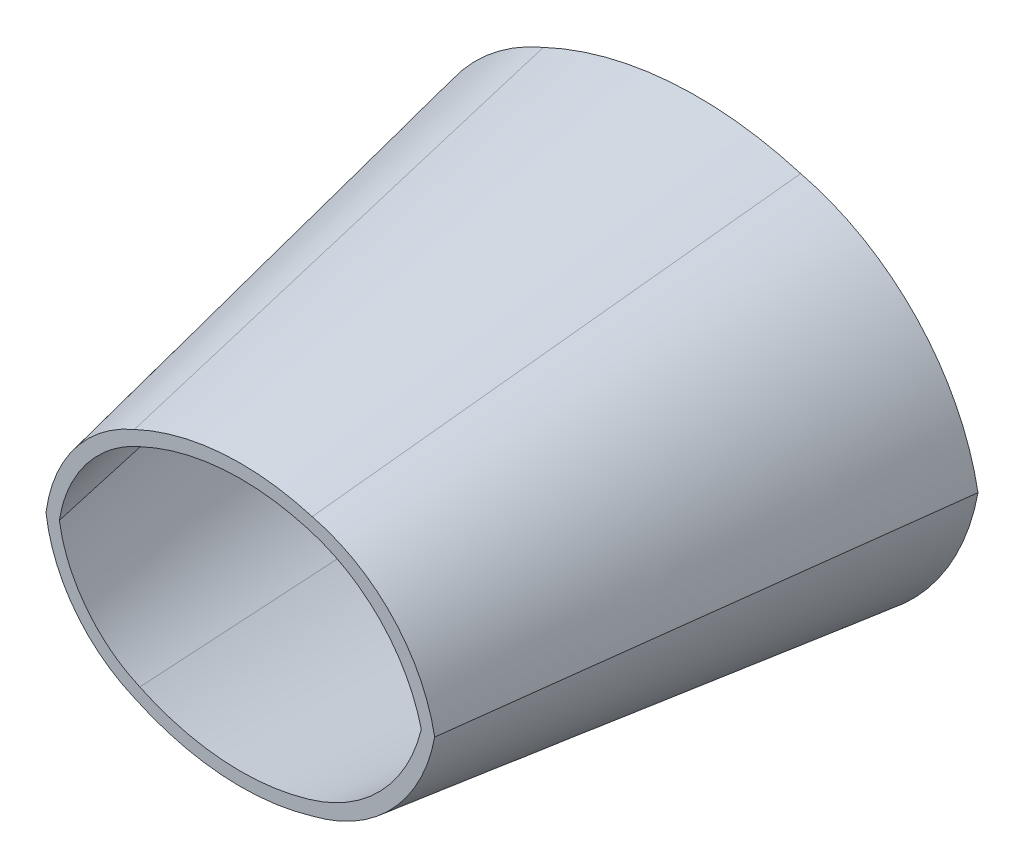
ISO-10303-21;
HEADER;
FILE_DESCRIPTION(('STEP AP214'),'2;1');
FILE_NAME('part.step','',(''),(''),'','','');
FILE_SCHEMA(('AUTOMOTIVE_DESIGN { 1 0 10303 214 1 1 1 1 }'));
ENDSEC;
DATA;
#1=APPLICATION_CONTEXT('core data for automotive mechanical design processes');
#2=APPLICATION_PROTOCOL_DEFINITION('international standard','automotive_design',2000,#1);
#3=PRODUCT_CONTEXT('',#1,'mechanical');
#4=PRODUCT('Part','Part','',(#3));
#5=PRODUCT_RELATED_PRODUCT_CATEGORY('part','',(#4));
#6=PRODUCT_DEFINITION_FORMATION('','',#4);
#7=PRODUCT_DEFINITION_CONTEXT('part definition',#1,'design');
#8=PRODUCT_DEFINITION('design','',#6,#7);
#9=PRODUCT_DEFINITION_SHAPE('','',#8);
#10=(LENGTH_UNIT() NAMED_UNIT(*) SI_UNIT(.MILLI.,.METRE.));
#11=(NAMED_UNIT(*) PLANE_ANGLE_UNIT() SI_UNIT($,.RADIAN.));
#12=(NAMED_UNIT(*) SI_UNIT($,.STERADIAN.) SOLID_ANGLE_UNIT());
#13=UNCERTAINTY_MEASURE_WITH_UNIT(LENGTH_MEASURE(1.E-05),#10,'distance_accuracy_value','');
#14=(GEOMETRIC_REPRESENTATION_CONTEXT(3) GLOBAL_UNCERTAINTY_ASSIGNED_CONTEXT((#13)) GLOBAL_UNIT_ASSIGNED_CONTEXT((#10,
#11,#12)) REPRESENTATION_CONTEXT('',''));
#15=CARTESIAN_POINT('',(0.,0.,0.));
#16=DIRECTION('',(0.,0.,1.));
#17=DIRECTION('',(1.,0.,0.));
#18=AXIS2_PLACEMENT_3D('',#15,#16,#17);
#19=CARTESIAN_POINT('',(-12.6655601020054,-8.00690456319089,0.));
#20=DIRECTION('',(0.,0.,-1.));
#21=DIRECTION('',(-1.,0.,0.));
#22=AXIS2_PLACEMENT_3D('',#19,#20,#21);
#23=PLANE('',#22);
#24=CARTESIAN_POINT('',(9.06036601108327,-10.222306806514,0.));
#25=DIRECTION('',(0.,0.,1.));
#26=DIRECTION('',(-1.,0.,0.));
#27=AXIS2_PLACEMENT_3D('',#24,#25,#26);
#28=CIRCLE('',#27,45.484296953617);
#29=CARTESIAN_POINT('',(53.793268102939,-1.98891505066619,0.));
#30=VERTEX_POINT('',#29);
#31=CARTESIAN_POINT('',(19.8193599105152,33.9711918062548,0.));
#32=VERTEX_POINT('',#31);
#33=EDGE_CURVE('E560',#30,#32,#28,.T.);
#34=ORIENTED_EDGE('',*,*,#33,.F.);
#35=CARTESIAN_POINT('',(9.06036601108326,6.24447670518163,0.));
#36=DIRECTION('',(0.,0.,-1.));
#37=DIRECTION('',(-1.,0.,0.));
#38=AXIS2_PLACEMENT_3D('',#35,#36,#37);
#39=CIRCLE('',#38,45.484296953617);
#40=CARTESIAN_POINT('',(19.8193599105153,-37.9490219075871,0.));
#41=VERTEX_POINT('',#40);
#42=EDGE_CURVE('E477',#30,#41,#39,.T.);
#43=ORIENTED_EDGE('',*,*,#42,.T.);
#44=CARTESIAN_POINT('',(0.0237006985835399,28.4188782777495,0.));
#45=DIRECTION('',(0.,0.,-1.));
#46=DIRECTION('',(-1.,0.,0.));
#47=AXIS2_PLACEMENT_3D('',#44,#45,#46);
#48=CIRCLE('',#47,69.2572472644253);
#49=CARTESIAN_POINT('',(-29.4869285013087,-34.2364412320272,0.));
#50=VERTEX_POINT('',#49);
#51=EDGE_CURVE('E487',#41,#50,#48,.T.);
#52=ORIENTED_EDGE('',*,*,#51,.T.);
#53=CARTESIAN_POINT('',(-13.7057072176419,3.18295541614373,0.));
#54=DIRECTION('',(0.,0.,-1.));
#55=DIRECTION('',(-1.,0.,0.));
#56=AXIS2_PLACEMENT_3D('',#53,#54,#55);
#57=CIRCLE('',#56,40.6110599555984);
#58=CARTESIAN_POINT('',(-53.9860988069965,-1.98891505066625,0.));
#59=VERTEX_POINT('',#58);
#60=EDGE_CURVE('E314',#50,#59,#57,.T.);
#61=ORIENTED_EDGE('',*,*,#60,.T.);
#62=CARTESIAN_POINT('',(-13.7057072176419,-7.16078551747613,0.));
#63=DIRECTION('',(0.,0.,1.));
#64=DIRECTION('',(-1.,0.,0.));
#65=AXIS2_PLACEMENT_3D('',#62,#63,#64);
#66=CIRCLE('',#65,40.6110599555984);
#67=CARTESIAN_POINT('',(-29.4869285013087,30.2586111306948,0.));
#68=VERTEX_POINT('',#67);
#69=EDGE_CURVE('E12',#68,#59,#66,.T.);
#70=ORIENTED_EDGE('',*,*,#69,.F.);
#71=CARTESIAN_POINT('',(0.0237006985835606,-32.3967083790819,0.));
#72=DIRECTION('',(0.,0.,1.));
#73=DIRECTION('',(-1.,0.,0.));
#74=AXIS2_PLACEMENT_3D('',#71,#72,#73);
#75=CIRCLE('',#74,69.2572472644253);
#76=EDGE_CURVE('E224',#32,#68,#75,.T.);
#77=ORIENTED_EDGE('',*,*,#76,.F.);
#78=EDGE_LOOP('',(#34,#43,#52,#61,#70,#77));
#79=FACE_BOUND('',#78,.T.);
#80=CARTESIAN_POINT('',(-12.6655601020054,-8.00690456319089,0.));
#81=DIRECTION('',(0.,0.,-1.));
#82=DIRECTION('',(-1.,0.,0.));
#83=AXIS2_PLACEMENT_3D('',#80,#81,#82);
#84=CIRCLE('',#83,38.098833712157);
#85=CARTESIAN_POINT('',(-50.2860988069965,-1.98891505066618,0.));
#86=VERTEX_POINT('',#85);
#87=CARTESIAN_POINT('',(-27.9797855687369,26.8785598680113,0.));
#88=VERTEX_POINT('',#87);
#89=EDGE_CURVE('E545',#86,#88,#84,.T.);
#90=ORIENTED_EDGE('',*,*,#89,.F.);
#91=CARTESIAN_POINT('',(-12.6655601020054,4.02907446185848,0.));
#92=DIRECTION('',(0.,0.,1.));
#93=DIRECTION('',(-1.,0.,0.));
#94=AXIS2_PLACEMENT_3D('',#91,#92,#93);
#95=CIRCLE('',#94,38.098833712157);
#96=CARTESIAN_POINT('',(-27.9797855687369,-30.8563899693437,0.));
#97=VERTEX_POINT('',#96);
#98=EDGE_CURVE('E443',#86,#97,#95,.T.);
#99=ORIENTED_EDGE('',*,*,#98,.T.);
#100=CARTESIAN_POINT('',(0.0237006985835399,28.4188782777495,0.));
#101=DIRECTION('',(0.,0.,1.));
#102=DIRECTION('',(-1.,0.,0.));
#103=AXIS2_PLACEMENT_3D('',#100,#101,#102);
#104=CIRCLE('',#103,65.5572472644242);
#105=CARTESIAN_POINT('',(18.7964914011617,-34.4235317513679,0.));
#106=VERTEX_POINT('',#105);
#107=EDGE_CURVE('E454',#97,#106,#104,.T.);
#108=ORIENTED_EDGE('',*,*,#107,.T.);
#109=CARTESIAN_POINT('',(6.60386853660439,8.69846982373068,0.));
#110=DIRECTION('',(0.,0.,1.));
#111=DIRECTION('',(-1.,0.,0.));
#112=AXIS2_PLACEMENT_3D('',#109,#110,#111);
#113=CIRCLE('',#112,44.7833459010578);
#114=CARTESIAN_POINT('',(50.0932681029389,-1.98891505066618,0.));
#115=VERTEX_POINT('',#114);
#116=EDGE_CURVE('E464',#106,#115,#113,.T.);
#117=ORIENTED_EDGE('',*,*,#116,.T.);
#118=CARTESIAN_POINT('',(6.6038685366044,-12.6762999250631,0.));
#119=DIRECTION('',(0.,0.,-1.));
#120=DIRECTION('',(-1.,0.,0.));
#121=AXIS2_PLACEMENT_3D('',#118,#119,#120);
#122=CIRCLE('',#121,44.7833459010578);
#123=CARTESIAN_POINT('',(18.7964914011616,30.4457016500356,0.));
#124=VERTEX_POINT('',#123);
#125=EDGE_CURVE('E238',#124,#115,#122,.T.);
#126=ORIENTED_EDGE('',*,*,#125,.F.);
#127=CARTESIAN_POINT('',(0.0237006985835606,-32.3967083790819,0.));
#128=DIRECTION('',(0.,0.,-1.));
#129=DIRECTION('',(-1.,0.,0.));
#130=AXIS2_PLACEMENT_3D('',#127,#128,#129);
#131=CIRCLE('',#130,65.5572472644242);
#132=EDGE_CURVE('E232',#88,#124,#131,.T.);
#133=ORIENTED_EDGE('',*,*,#132,.F.);
#134=EDGE_LOOP('',(#90,#99,#108,#117,#126,#133));
#135=FACE_BOUND('',#134,.T.);
#136=ADVANCED_FACE('F214',(#79,#135),#23,.T.);
#137=CARTESIAN_POINT('',(-3.61848238541433,-6.15479873574024,92.59));
#138=DIRECTION('',(0.,0.,1.));
#139=DIRECTION('',(1.,0.,0.));
#140=AXIS2_PLACEMENT_3D('',#137,#138,#139);
#141=PLANE('',#140);
#142=CARTESIAN_POINT('',(11.391568899451,3.70755016708821,92.59));
#143=DIRECTION('',(0.,0.,-1.));
#144=DIRECTION('',(1.,0.,0.));
#145=AXIS2_PLACEMENT_3D('',#142,#143,#144);
#146=CIRCLE('',#145,31.4242820479088);
#147=CARTESIAN_POINT('',(42.2952221826704,-1.98891505066618,92.59));
#148=VERTEX_POINT('',#147);
#149=CARTESIAN_POINT('',(18.8247641226774,-26.8249425414989,92.59));
#150=VERTEX_POINT('',#149);
#151=EDGE_CURVE('E330',#148,#150,#146,.T.);
#152=ORIENTED_EDGE('',*,*,#151,.F.);
#153=CARTESIAN_POINT('',(11.391568899451,-7.68538026842059,92.59));
#154=DIRECTION('',(0.,0.,1.));
#155=DIRECTION('',(1.,0.,0.));
#156=AXIS2_PLACEMENT_3D('',#153,#154,#155);
#157=CIRCLE('',#156,31.4242820479088);
#158=CARTESIAN_POINT('',(18.8247641226774,22.8471124401666,92.59));
#159=VERTEX_POINT('',#158);
#160=EDGE_CURVE('E526',#148,#159,#157,.T.);
#161=ORIENTED_EDGE('',*,*,#160,.T.);
#162=CARTESIAN_POINT('',(5.14829949501317,-23.005275175701,92.59));
#163=DIRECTION('',(0.,0.,1.));
#164=DIRECTION('',(1.,0.,0.));
#165=AXIS2_PLACEMENT_3D('',#162,#163,#164);
#166=CIRCLE('',#165,47.8485855045634);
#167=CARTESIAN_POINT('',(-15.2400630278623,20.2821572778798,92.59));
#168=VERTEX_POINT('',#167);
#169=EDGE_CURVE('E592',#159,#168,#166,.T.);
#170=ORIENTED_EDGE('',*,*,#169,.T.);
#171=CARTESIAN_POINT('',(-4.33710130496002,-5.57023031720181,92.59));
#172=DIRECTION('',(0.,0.,1.));
#173=DIRECTION('',(1.,0.,0.));
#174=AXIS2_PLACEMENT_3D('',#171,#172,#173);
#175=CIRCLE('',#174,28.0574503242437);
#176=CARTESIAN_POINT('',(-32.1650494804738,-1.98891505066618,92.59));
#177=VERTEX_POINT('',#176);
#178=EDGE_CURVE('E338',#168,#177,#175,.T.);
#179=ORIENTED_EDGE('',*,*,#178,.T.);
#180=CARTESIAN_POINT('',(-4.33710130496002,1.59240021586942,92.59));
#181=DIRECTION('',(0.,0.,-1.));
#182=DIRECTION('',(1.,0.,0.));
#183=AXIS2_PLACEMENT_3D('',#180,#181,#182);
#184=CIRCLE('',#183,28.0574503242437);
#185=CARTESIAN_POINT('',(-15.2400630278623,-24.2599873792122,92.59));
#186=VERTEX_POINT('',#185);
#187=EDGE_CURVE('E311',#186,#177,#184,.T.);
#188=ORIENTED_EDGE('',*,*,#187,.F.);
#189=CARTESIAN_POINT('',(5.14829949501315,19.0274450743686,92.59));
#190=DIRECTION('',(0.,0.,-1.));
#191=DIRECTION('',(1.,0.,0.));
#192=AXIS2_PLACEMENT_3D('',#189,#190,#191);
#193=CIRCLE('',#192,47.8485855045634);
#194=EDGE_CURVE('E323',#150,#186,#193,.T.);
#195=ORIENTED_EDGE('',*,*,#194,.F.);
#196=EDGE_LOOP('',(#152,#161,#170,#179,#188,#195));
#197=FACE_BOUND('',#196,.T.);
#198=CARTESIAN_POINT('',(-3.61848238541433,-6.15479873574024,92.59));
#199=DIRECTION('',(0.,0.,-1.));
#200=DIRECTION('',(1.,0.,0.));
#201=AXIS2_PLACEMENT_3D('',#198,#199,#200);
#202=CIRCLE('',#201,26.3217984327224);
#203=CARTESIAN_POINT('',(-29.6085282848602,-1.98891505066618,92.59));
#204=VERTEX_POINT('',#203);
#205=CARTESIAN_POINT('',(-14.1988051043368,17.9469407014108,92.59));
#206=VERTEX_POINT('',#205);
#207=EDGE_CURVE('E497',#204,#206,#202,.T.);
#208=ORIENTED_EDGE('',*,*,#207,.T.);
#209=CARTESIAN_POINT('',(5.14829949501317,-23.005275175701,92.59));
#210=DIRECTION('',(0.,0.,-1.));
#211=DIRECTION('',(1.,0.,0.));
#212=AXIS2_PLACEMENT_3D('',#209,#210,#211);
#213=CIRCLE('',#212,45.2923221045659);
#214=CARTESIAN_POINT('',(18.1180819645237,20.4114122697298,92.59));
#215=VERTEX_POINT('',#214);
#216=EDGE_CURVE('E525',#206,#215,#213,.T.);
#217=ORIENTED_EDGE('',*,*,#216,.T.);
#218=CARTESIAN_POINT('',(9.69441901128545,-9.38079994214532,92.59));
#219=DIRECTION('',(0.,0.,-1.));
#220=DIRECTION('',(1.,0.,0.));
#221=AXIS2_PLACEMENT_3D('',#218,#219,#220);
#222=CIRCLE('',#221,30.9400075828146);
#223=CARTESIAN_POINT('',(39.7384551412023,-1.98891505066618,92.59));
#224=VERTEX_POINT('',#223);
#225=EDGE_CURVE('E523',#215,#224,#222,.T.);
#226=ORIENTED_EDGE('',*,*,#225,.T.);
#227=CARTESIAN_POINT('',(9.69441901128545,5.40296984081294,92.59));
#228=DIRECTION('',(0.,0.,1.));
#229=DIRECTION('',(1.,0.,0.));
#230=AXIS2_PLACEMENT_3D('',#227,#228,#229);
#231=CIRCLE('',#230,30.9400075828146);
#232=CARTESIAN_POINT('',(18.1180819645237,-24.3892423710622,92.59));
#233=VERTEX_POINT('',#232);
#234=EDGE_CURVE('E527',#233,#224,#231,.T.);
#235=ORIENTED_EDGE('',*,*,#234,.F.);
#236=CARTESIAN_POINT('',(5.14829949501315,19.0274450743686,92.59));
#237=DIRECTION('',(0.,0.,1.));
#238=DIRECTION('',(1.,0.,0.));
#239=AXIS2_PLACEMENT_3D('',#236,#237,#238);
#240=CIRCLE('',#239,45.2923221045659);
#241=CARTESIAN_POINT('',(-14.1988051043368,-21.9247708027432,92.59));
#242=VERTEX_POINT('',#241);
#243=EDGE_CURVE('E429',#242,#233,#240,.T.);
#244=ORIENTED_EDGE('',*,*,#243,.F.);
#245=CARTESIAN_POINT('',(-3.61848238541433,2.17696863440785,92.59));
#246=DIRECTION('',(0.,0.,1.));
#247=DIRECTION('',(1.,0.,0.));
#248=AXIS2_PLACEMENT_3D('',#245,#246,#247);
#249=CIRCLE('',#248,26.3217984327224);
#250=EDGE_CURVE('E341',#204,#242,#249,.T.);
#251=ORIENTED_EDGE('',*,*,#250,.F.);
#252=EDGE_LOOP('',(#208,#217,#226,#235,#244,#251));
#253=FACE_BOUND('',#252,.T.);
#254=ADVANCED_FACE('F335',(#197,#253),#141,.T.);
#255=CARTESIAN_POINT('',(39.7384551412023,-1.98891505066616,92.59));
#256=CARTESIAN_POINT('',(50.0932681029389,-1.98891505066619,0.));
#257=CARTESIAN_POINT('',(39.0891569813181,0.650132724162398,92.59));
#258=CARTESIAN_POINT('',(49.1543754321577,1.83165274860205,0.));
#259=CARTESIAN_POINT('',(37.0915829083562,5.75580741413836,92.59));
#260=CARTESIAN_POINT('',(46.2643237885429,9.22418918531569,0.));
#261=CARTESIAN_POINT('',(32.2033559008326,12.3688938173354,92.5900000000001));
#262=CARTESIAN_POINT('',(39.1884041607721,18.8005768391056,0.));
#263=CARTESIAN_POINT('',(25.7618233026619,17.4810687791242,92.59));
#264=CARTESIAN_POINT('',(29.8623611382587,26.2033304225062,0.));
#265=CARTESIAN_POINT('',(20.7276681281979,19.6525884995614,92.59));
#266=CARTESIAN_POINT('',(22.5741550442845,29.3472205927666,0.));
#267=CARTESIAN_POINT('',(15.4666684735592,21.182398723251,92.59));
#268=CARTESIAN_POINT('',(14.9582781031926,31.5617895286514,0.));
#269=CARTESIAN_POINT('',(10.0299431853361,22.2781018317451,92.5899999999999));
#270=CARTESIAN_POINT('',(7.08878210891418,33.1476199730223,0.));
#271=CARTESIAN_POINT('',(1.71156322772433,22.4104894891621,92.59));
#272=CARTESIAN_POINT('',(-4.95071439823449,33.3391665360914,0.));
#273=CARTESIAN_POINT('',(-6.49216878035074,21.027828015512,92.5900000000001));
#274=CARTESIAN_POINT('',(-16.8242861947417,31.3380520904247,0.));
#275=CARTESIAN_POINT('',(-11.7020976662892,19.1264631991147,92.59));
#276=CARTESIAN_POINT('',(-24.3655263301193,28.5860487069188,0.));
#277=CARTESIAN_POINT('',(-14.1988051043368,17.9469407014108,92.59));
#278=CARTESIAN_POINT('',(-27.9797855687369,26.8785598680113,0.));
#279=B_SPLINE_SURFACE_WITH_KNOTS('',3,1,((#255,#256),(#257,#258),(#259,#260),(#261,#262),(#263,
#264),(#265,#266),(#267,#268),(#269,#270),(#271,#272),(#273,#274),(#275,#276),(#277,#278)),
.UNSPECIFIED.,.F.,.F.,.F.,(4,1,1,1,2,1,1,1,4),(2,2),(0.,0.124006247559485,0.24801249511897,
0.372018742678454,0.496024990237939,0.622018742678454,0.74801249511897,0.874006247559485,1.),
(0.,1.),.UNSPECIFIED.);
#280=DIRECTION('',(-0.146551474496138,0.094981773022944,-0.98463248378084));
#281=VECTOR('',#280,1.);
#282=CARTESIAN_POINT('',(-21.0892953365369,22.412750284711,46.295));
#283=LINE('',#282,#281);
#284=EDGE_CURVE('E659',#206,#88,#283,.T.);
#285=DIRECTION('',(0.111142237990361,0.,-0.993804509415455));
#286=VECTOR('',#285,1.);
#287=CARTESIAN_POINT('',(44.9158616220706,-1.98891505066618,46.295));
#288=LINE('',#287,#286);
#289=EDGE_CURVE('E666',#224,#115,#288,.T.);
#290=ORIENTED_EDGE('',*,*,#225,.F.);
#291=ORIENTED_EDGE('',*,*,#216,.F.);
#292=ORIENTED_EDGE('',*,*,#284,.T.);
#293=ORIENTED_EDGE('',*,*,#132,.T.);
#294=ORIENTED_EDGE('',*,*,#125,.T.);
#295=ORIENTED_EDGE('',*,*,#289,.F.);
#296=EDGE_LOOP('',(#290,#291,#292,#293,#294,#295));
#297=FACE_BOUND('',#296,.T.);
#298=ADVANCED_FACE('F361',(#297),#279,.T.);
#299=CARTESIAN_POINT('',(18.8247641226774,22.8471124401665,92.59));
#300=CARTESIAN_POINT('',(19.8193599105153,33.9711918062548,0.));
#301=CARTESIAN_POINT('',(30.856735460675,19.9179054235889,92.59));
#302=CARTESIAN_POINT('',(37.2389639166056,29.73035505164,0.));
#303=CARTESIAN_POINT('',(40.050410175931,10.1893199232026,92.59));
#304=CARTESIAN_POINT('',(50.5479395248472,15.6433038263927,0.));
#305=CARTESIAN_POINT('',(42.2952221826704,-1.98891505066618,92.59));
#306=CARTESIAN_POINT('',(53.793268102939,-1.9889150506662,0.));
#307=B_SPLINE_SURFACE_WITH_KNOTS('',3,1,((#299,#300),(#301,#302),(#303,#304),(#305,#306)),
.UNSPECIFIED.,.F.,.F.,.F.,(4,4),(2,2),(0.,1.),(0.,1.),.UNSPECIFIED.);
#308=DIRECTION('',(-0.123235782853256,0.,0.992377419042042));
#309=VECTOR('',#308,1.);
#310=CARTESIAN_POINT('',(48.0442451428047,-1.98891505066618,46.295));
#311=LINE('',#310,#309);
#312=EDGE_CURVE('E532',#30,#148,#311,.T.);
#313=DIRECTION('',(0.0106646311681912,0.11927881152897,-0.992803520724158));
#314=VECTOR('',#313,1.);
#315=CARTESIAN_POINT('',(19.3220620165963,28.4091521232107,46.295));
#316=LINE('',#315,#314);
#317=EDGE_CURVE('E586',#159,#32,#316,.T.);
#318=ORIENTED_EDGE('',*,*,#160,.F.);
#319=ORIENTED_EDGE('',*,*,#312,.F.);
#320=ORIENTED_EDGE('',*,*,#33,.T.);
#321=ORIENTED_EDGE('',*,*,#317,.F.);
#322=EDGE_LOOP('',(#318,#319,#320,#321));
#323=FACE_BOUND('',#322,.T.);
#324=ADVANCED_FACE('F585',(#323),#307,.T.);
#325=CARTESIAN_POINT('',(-14.1988051043368,17.9469407014108,92.59));
#326=CARTESIAN_POINT('',(-27.979785568737,26.8785598680116,0.));
#327=CARTESIAN_POINT('',(-22.3881479937609,14.3519350026743,92.59));
#328=CARTESIAN_POINT('',(-39.8371356209257,21.6733509049696,0.));
#329=CARTESIAN_POINT('',(-28.193035016273,6.84204082857432,92.59));
#330=CARTESIAN_POINT('',(-48.2406220038675,10.7980695530991,0.));
#331=CARTESIAN_POINT('',(-29.6085282848602,-1.98891505066619,92.59));
#332=CARTESIAN_POINT('',(-50.2860988069965,-1.98891505066618,0.));
#333=B_SPLINE_SURFACE_WITH_KNOTS('',3,1,((#325,#326),(#327,#328),(#329,#330),(#331,#332)),
.UNSPECIFIED.,.F.,.F.,.F.,(4,4),(2,2),(0.,1.),(0.,1.),.UNSPECIFIED.);
#334=DIRECTION('',(-0.217955039846895,0.,-0.975958810916392));
#335=VECTOR('',#334,1.);
#336=CARTESIAN_POINT('',(-39.9473135459283,-1.98891505066619,46.295));
#337=LINE('',#336,#335);
#338=EDGE_CURVE('E662',#204,#86,#337,.T.);
#339=ORIENTED_EDGE('',*,*,#207,.F.);
#340=ORIENTED_EDGE('',*,*,#338,.T.);
#341=ORIENTED_EDGE('',*,*,#89,.T.);
#342=ORIENTED_EDGE('',*,*,#284,.F.);
#343=EDGE_LOOP('',(#339,#340,#341,#342));
#344=FACE_BOUND('',#343,.T.);
#345=ADVANCED_FACE('F618',(#344),#333,.T.);
#346=CARTESIAN_POINT('',(-32.1650494804738,-1.98891505066618,92.59));
#347=CARTESIAN_POINT('',(-53.9860988069965,-1.98891505066617,0.));
#348=CARTESIAN_POINT('',(-30.890226966907,7.916857605544,92.59));
#349=CARTESIAN_POINT('',(-52.1445531072998,12.3537067124861,0.));
#350=CARTESIAN_POINT('',(-24.4426054690776,16.4010856507067,92.59));
#351=CARTESIAN_POINT('',(-42.8108370223947,24.63939843436,0.));
#352=CARTESIAN_POINT('',(-15.2400630278623,20.2821572778798,92.59));
#353=CARTESIAN_POINT('',(-29.4869285013087,30.2586111306948,0.));
#354=B_SPLINE_SURFACE_WITH_KNOTS('',3,1,((#346,#347),(#348,#349),(#350,#351),(#352,#353)),
.UNSPECIFIED.,.F.,.F.,.F.,(4,4),(2,2),(0.,1.),(0.,1.),.UNSPECIFIED.);
#355=DIRECTION('',(-0.151225520878649,0.105896587093188,-0.982810640294964));
#356=VECTOR('',#355,1.);
#357=CARTESIAN_POINT('',(-22.3634957645855,25.2703842042873,46.295));
#358=LINE('',#357,#356);
#359=EDGE_CURVE('E594',#168,#68,#358,.T.);
#360=DIRECTION('',(-0.229389611617061,0.,-0.973334683488765));
#361=VECTOR('',#360,1.);
#362=CARTESIAN_POINT('',(-43.0755741437351,-1.98891505066618,46.295));
#363=LINE('',#362,#361);
#364=EDGE_CURVE('E596',#177,#59,#363,.T.);
#365=ORIENTED_EDGE('',*,*,#178,.F.);
#366=ORIENTED_EDGE('',*,*,#359,.T.);
#367=ORIENTED_EDGE('',*,*,#69,.T.);
#368=ORIENTED_EDGE('',*,*,#364,.F.);
#369=EDGE_LOOP('',(#365,#366,#367,#368));
#370=FACE_BOUND('',#369,.T.);
#371=ADVANCED_FACE('F695',(#370),#354,.T.);
#372=CARTESIAN_POINT('',(-15.2400630278623,20.2821572778798,92.59));
#373=CARTESIAN_POINT('',(-29.4869285013087,30.2586111306948,0.));
#374=CARTESIAN_POINT('',(-4.58793147069062,25.2993067718321,92.59));
#375=CARTESIAN_POINT('',(-14.0687651142616,37.5205596167688,0.));
#376=CARTESIAN_POINT('',(7.54145075872559,26.2126042744792,92.59));
#377=CARTESIAN_POINT('',(3.48760808610579,38.8424894146923,0.));
#378=CARTESIAN_POINT('',(18.8247641226774,22.8471124401666,92.59));
#379=CARTESIAN_POINT('',(19.8193599105153,33.9711918062548,0.));
#380=B_SPLINE_SURFACE_WITH_KNOTS('',3,1,((#372,#373),(#374,#375),(#376,#377),(#378,#379)),
.UNSPECIFIED.,.F.,.F.,.F.,(4,4),(2,2),(0.,1.),(0.,1.),.UNSPECIFIED.);
#381=ORIENTED_EDGE('',*,*,#169,.F.);
#382=ORIENTED_EDGE('',*,*,#317,.T.);
#383=ORIENTED_EDGE('',*,*,#76,.T.);
#384=ORIENTED_EDGE('',*,*,#359,.F.);
#385=EDGE_LOOP('',(#381,#382,#383,#384));
#386=FACE_BOUND('',#385,.T.);
#387=ADVANCED_FACE('F591',(#386),#380,.T.);
#388=CARTESIAN_POINT('',(39.7384551412023,-1.9889150506662,92.59));
#389=CARTESIAN_POINT('',(50.0932681029389,-1.98891505066618,0.));
#390=CARTESIAN_POINT('',(39.0891569813181,-4.62796282549476,92.59));
#391=CARTESIAN_POINT('',(49.1543754321577,-5.80948284993441,0.));
#392=CARTESIAN_POINT('',(37.0915829083562,-9.73363751547073,92.59));
#393=CARTESIAN_POINT('',(46.264323788543,-13.2020192866481,0.));
#394=CARTESIAN_POINT('',(32.2033559008326,-16.3467239186678,92.5900000000001));
#395=CARTESIAN_POINT('',(39.1884041607721,-22.778406940438,0.));
#396=CARTESIAN_POINT('',(25.7618233026619,-21.4588988804565,92.59));
#397=CARTESIAN_POINT('',(29.8623611382587,-30.1811605238385,0.));
#398=CARTESIAN_POINT('',(20.7276681281979,-23.6304186008938,92.59));
#399=CARTESIAN_POINT('',(22.5741550442845,-33.325050694099,0.));
#400=CARTESIAN_POINT('',(15.4666684735593,-25.1602288245834,92.59));
#401=CARTESIAN_POINT('',(14.9582781031926,-35.5396196299838,0.));
#402=CARTESIAN_POINT('',(10.0299431853361,-26.2559319330775,92.5899999999999));
#403=CARTESIAN_POINT('',(7.0887821089142,-37.1254500743547,0.));
#404=CARTESIAN_POINT('',(1.71156322772435,-26.3883195904945,92.59));
#405=CARTESIAN_POINT('',(-4.95071439823446,-37.3169966374238,0.));
#406=CARTESIAN_POINT('',(-6.49216878035073,-25.0056581168444,92.5900000000001));
#407=CARTESIAN_POINT('',(-16.8242861947416,-35.3158821917572,0.));
#408=CARTESIAN_POINT('',(-11.7020976662892,-23.1042933004471,92.59));
#409=CARTESIAN_POINT('',(-24.3655263301193,-32.5638788082512,0.));
#410=CARTESIAN_POINT('',(-14.1988051043368,-21.9247708027432,92.59));
#411=CARTESIAN_POINT('',(-27.9797855687369,-30.8563899693437,0.));
#412=B_SPLINE_SURFACE_WITH_KNOTS('',3,1,((#388,#389),(#390,#391),(#392,#393),(#394,#395),(#396,
#397),(#398,#399),(#400,#401),(#402,#403),(#404,#405),(#406,#407),(#408,#409),(#410,#411)),
.UNSPECIFIED.,.F.,.F.,.F.,(4,1,1,1,2,1,1,1,4),(2,2),(0.,0.124006247559485,0.24801249511897,
0.372018742678454,0.496024990237939,0.622018742678454,0.74801249511897,0.874006247559485,1.),
(0.,1.),.UNSPECIFIED.);
#413=DIRECTION('',(-0.146551474496138,-0.0949817730229442,-0.98463248378084));
#414=VECTOR('',#413,1.);
#415=CARTESIAN_POINT('',(-21.0892953365368,-26.3905803860434,46.295));
#416=LINE('',#415,#414);
#417=EDGE_CURVE('E320',#242,#97,#416,.T.);
#418=ORIENTED_EDGE('',*,*,#234,.T.);
#419=ORIENTED_EDGE('',*,*,#289,.T.);
#420=ORIENTED_EDGE('',*,*,#116,.F.);
#421=ORIENTED_EDGE('',*,*,#107,.F.);
#422=ORIENTED_EDGE('',*,*,#417,.F.);
#423=ORIENTED_EDGE('',*,*,#243,.T.);
#424=EDGE_LOOP('',(#418,#419,#420,#421,#422,#423));
#425=FACE_BOUND('',#424,.T.);
#426=ADVANCED_FACE('F791',(#425),#412,.F.);
#427=CARTESIAN_POINT('',(18.8247641226774,-26.8249425414989,92.59));
#428=CARTESIAN_POINT('',(19.8193599105153,-37.9490219075871,0.));
#429=CARTESIAN_POINT('',(30.856735460675,-23.8957355249212,92.59));
#430=CARTESIAN_POINT('',(37.2389639166056,-33.7081851529724,0.));
#431=CARTESIAN_POINT('',(40.050410175931,-14.167150024535,92.59));
#432=CARTESIAN_POINT('',(50.5479395248472,-19.621133927725,0.));
#433=CARTESIAN_POINT('',(42.2952221826704,-1.98891505066618,92.59));
#434=CARTESIAN_POINT('',(53.793268102939,-1.98891505066616,0.));
#435=B_SPLINE_SURFACE_WITH_KNOTS('',3,1,((#427,#428),(#429,#430),(#431,#432),(#433,#434)),
.UNSPECIFIED.,.F.,.F.,.F.,(4,4),(2,2),(0.,1.),(0.,1.),.UNSPECIFIED.);
#436=DIRECTION('',(0.0106646311681913,-0.11927881152897,-0.992803520724158));
#437=VECTOR('',#436,1.);
#438=CARTESIAN_POINT('',(19.3220620165964,-32.386982224543,46.295));
#439=LINE('',#438,#437);
#440=EDGE_CURVE('E319',#150,#41,#439,.T.);
#441=ORIENTED_EDGE('',*,*,#151,.T.);
#442=ORIENTED_EDGE('',*,*,#440,.T.);
#443=ORIENTED_EDGE('',*,*,#42,.F.);
#444=ORIENTED_EDGE('',*,*,#312,.T.);
#445=EDGE_LOOP('',(#441,#442,#443,#444));
#446=FACE_BOUND('',#445,.T.);
#447=ADVANCED_FACE('F764',(#446),#435,.F.);
#448=CARTESIAN_POINT('',(-14.1988051043368,-21.9247708027432,92.59));
#449=CARTESIAN_POINT('',(-27.979785568737,-30.856389969344,0.));
#450=CARTESIAN_POINT('',(-22.3881479937609,-18.3297651040067,92.59));
#451=CARTESIAN_POINT('',(-39.8371356209257,-25.651181006302,0.));
#452=CARTESIAN_POINT('',(-28.193035016273,-10.8198709299067,92.59));
#453=CARTESIAN_POINT('',(-48.2406220038675,-14.7758996544316,0.));
#454=CARTESIAN_POINT('',(-29.6085282848602,-1.98891505066622,92.59));
#455=CARTESIAN_POINT('',(-50.2860988069965,-1.98891505066625,0.));
#456=B_SPLINE_SURFACE_WITH_KNOTS('',3,1,((#448,#449),(#450,#451),(#452,#453),(#454,#455)),
.UNSPECIFIED.,.F.,.F.,.F.,(4,4),(2,2),(0.,1.),(0.,1.),.UNSPECIFIED.);
#457=ORIENTED_EDGE('',*,*,#250,.T.);
#458=ORIENTED_EDGE('',*,*,#417,.T.);
#459=ORIENTED_EDGE('',*,*,#98,.F.);
#460=ORIENTED_EDGE('',*,*,#338,.F.);
#461=EDGE_LOOP('',(#457,#458,#459,#460));
#462=FACE_BOUND('',#461,.T.);
#463=ADVANCED_FACE('F745',(#462),#456,.F.);
#464=CARTESIAN_POINT('',(-32.1650494804738,-1.98891505066623,92.59));
#465=CARTESIAN_POINT('',(-53.9860988069965,-1.98891505066626,0.));
#466=CARTESIAN_POINT('',(-30.890226966907,-11.8946877068764,92.59));
#467=CARTESIAN_POINT('',(-52.1445531072998,-16.3315368138185,0.));
#468=CARTESIAN_POINT('',(-24.4426054690776,-20.3789157520391,92.59));
#469=CARTESIAN_POINT('',(-42.8108370223947,-28.6172285356924,0.));
#470=CARTESIAN_POINT('',(-15.2400630278623,-24.2599873792122,92.59));
#471=CARTESIAN_POINT('',(-29.4869285013087,-34.2364412320272,0.));
#472=B_SPLINE_SURFACE_WITH_KNOTS('',3,1,((#464,#465),(#466,#467),(#468,#469),(#470,#471)),
.UNSPECIFIED.,.F.,.F.,.F.,(4,4),(2,2),(0.,1.),(0.,1.),.UNSPECIFIED.);
#473=DIRECTION('',(-0.151225520878649,-0.105896587093188,-0.982810640294964));
#474=VECTOR('',#473,1.);
#475=CARTESIAN_POINT('',(-22.3634957645855,-29.2482143056197,46.295));
#476=LINE('',#475,#474);
#477=EDGE_CURVE('E306',#186,#50,#476,.T.);
#478=ORIENTED_EDGE('',*,*,#187,.T.);
#479=ORIENTED_EDGE('',*,*,#364,.T.);
#480=ORIENTED_EDGE('',*,*,#60,.F.);
#481=ORIENTED_EDGE('',*,*,#477,.F.);
#482=EDGE_LOOP('',(#478,#479,#480,#481));
#483=FACE_BOUND('',#482,.T.);
#484=ADVANCED_FACE('F308',(#483),#472,.F.);
#485=CARTESIAN_POINT('',(-15.2400630278623,-24.2599873792122,92.59));
#486=CARTESIAN_POINT('',(-29.4869285013087,-34.2364412320273,0.));
#487=CARTESIAN_POINT('',(-4.5879314706906,-29.2771368731645,92.59));
#488=CARTESIAN_POINT('',(-14.0687651142616,-41.4983897181012,0.));
#489=CARTESIAN_POINT('',(7.54145075872561,-30.1904343758115,92.59));
#490=CARTESIAN_POINT('',(3.48760808610582,-42.8203195160247,0.));
#491=CARTESIAN_POINT('',(18.8247641226774,-26.8249425414989,92.59));
#492=CARTESIAN_POINT('',(19.8193599105153,-37.9490219075871,0.));
#493=B_SPLINE_SURFACE_WITH_KNOTS('',3,1,((#485,#486),(#487,#488),(#489,#490),(#491,#492)),
.UNSPECIFIED.,.F.,.F.,.F.,(4,4),(2,2),(0.,1.),(0.,1.),.UNSPECIFIED.);
#494=ORIENTED_EDGE('',*,*,#194,.T.);
#495=ORIENTED_EDGE('',*,*,#477,.T.);
#496=ORIENTED_EDGE('',*,*,#51,.F.);
#497=ORIENTED_EDGE('',*,*,#440,.F.);
#498=EDGE_LOOP('',(#494,#495,#496,#497));
#499=FACE_BOUND('',#498,.T.);
#500=ADVANCED_FACE('F325',(#499),#493,.F.);
#501=CLOSED_SHELL('',(#136,#254,#298,#324,#345,#371,#387,#426,#447,#463,#484,#500));
#502=MANIFOLD_SOLID_BREP('B2',#501);
#503=ADVANCED_BREP_SHAPE_REPRESENTATION('',(#18,#502),#14);
#504=SHAPE_DEFINITION_REPRESENTATION(#9,#503);
ENDSEC;
END-ISO-10303-21;
